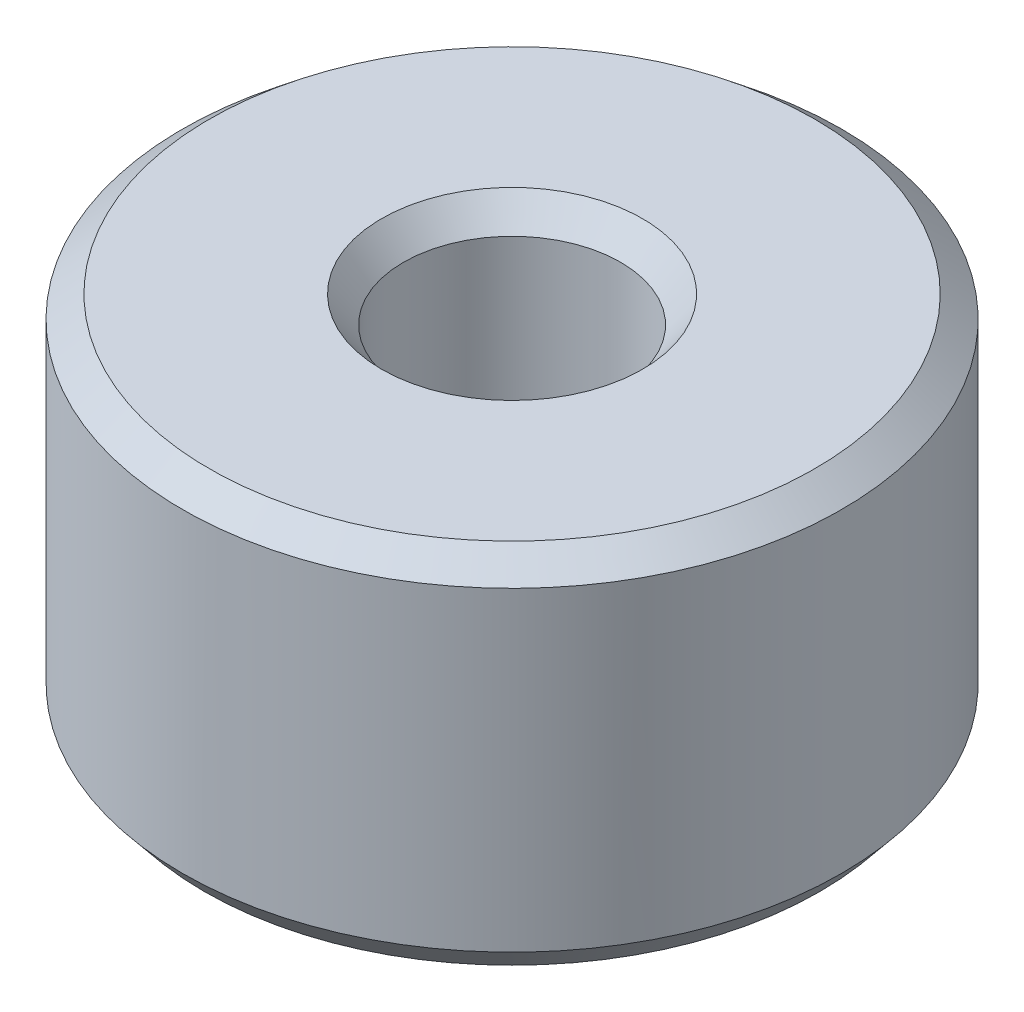
ISO-10303-21;
HEADER;
FILE_DESCRIPTION(('STEP AP214'),'2;1');
FILE_NAME('part.step','',(''),(''),'','','');
FILE_SCHEMA(('AUTOMOTIVE_DESIGN { 1 0 10303 214 1 1 1 1 }'));
ENDSEC;
DATA;
#1=APPLICATION_CONTEXT('core data for automotive mechanical design processes');
#2=APPLICATION_PROTOCOL_DEFINITION('international standard','automotive_design',2000,#1);
#3=PRODUCT_CONTEXT('',#1,'mechanical');
#4=PRODUCT('Part','Part','',(#3));
#5=PRODUCT_RELATED_PRODUCT_CATEGORY('part','',(#4));
#6=PRODUCT_DEFINITION_FORMATION('','',#4);
#7=PRODUCT_DEFINITION_CONTEXT('part definition',#1,'design');
#8=PRODUCT_DEFINITION('design','',#6,#7);
#9=PRODUCT_DEFINITION_SHAPE('','',#8);
#10=(LENGTH_UNIT() NAMED_UNIT(*) SI_UNIT(.MILLI.,.METRE.));
#11=(NAMED_UNIT(*) PLANE_ANGLE_UNIT() SI_UNIT($,.RADIAN.));
#12=(NAMED_UNIT(*) SI_UNIT($,.STERADIAN.) SOLID_ANGLE_UNIT());
#13=UNCERTAINTY_MEASURE_WITH_UNIT(LENGTH_MEASURE(1.E-05),#10,'distance_accuracy_value','');
#14=(GEOMETRIC_REPRESENTATION_CONTEXT(3) GLOBAL_UNCERTAINTY_ASSIGNED_CONTEXT((#13)) GLOBAL_UNIT_ASSIGNED_CONTEXT((#10,
#11,#12)) REPRESENTATION_CONTEXT('',''));
#15=CARTESIAN_POINT('',(0.,0.,0.));
#16=DIRECTION('',(0.,0.,1.));
#17=DIRECTION('',(1.,0.,0.));
#18=AXIS2_PLACEMENT_3D('',#15,#16,#17);
#19=CARTESIAN_POINT('',(0.,5.5202389889284,0.));
#20=DIRECTION('',(0.,-1.,0.));
#21=DIRECTION('',(0.,0.,-1.));
#22=AXIS2_PLACEMENT_3D('',#19,#20,#21);
#23=CYLINDRICAL_SURFACE('',#22,5.);
#24=CARTESIAN_POINT('',(0.,0.406698637745864,0.));
#25=DIRECTION('',(0.,1.,0.));
#26=DIRECTION('',(0.,0.,1.));
#27=AXIS2_PLACEMENT_3D('',#24,#25,#26);
#28=CIRCLE('',#27,5.);
#29=CARTESIAN_POINT('',(0.,0.406698637745864,5.));
#30=VERTEX_POINT('',#29);
#31=EDGE_CURVE('E10',#30,#30,#28,.T.);
#32=ORIENTED_EDGE('',*,*,#31,.T.);
#33=EDGE_LOOP('',(#32));
#34=FACE_BOUND('',#33,.T.);
#35=CARTESIAN_POINT('',(0.,5.1872709028626,0.));
#36=DIRECTION('',(0.,1.,0.));
#37=DIRECTION('',(0.,0.,1.));
#38=AXIS2_PLACEMENT_3D('',#35,#36,#37);
#39=CIRCLE('',#38,5.);
#40=CARTESIAN_POINT('',(0.,5.1872709028626,-5.));
#41=VERTEX_POINT('',#40);
#42=EDGE_CURVE('E50',#41,#41,#39,.F.);
#43=ORIENTED_EDGE('',*,*,#42,.T.);
#44=EDGE_LOOP('',(#43));
#45=FACE_BOUND('',#44,.T.);
#46=ADVANCED_FACE('F39',(#34,#45),#23,.T.);
#47=CARTESIAN_POINT('',(0.,5.5202389889284,0.));
#48=DIRECTION('',(0.,1.,0.));
#49=DIRECTION('',(0.,0.,1.));
#50=AXIS2_PLACEMENT_3D('',#47,#48,#49);
#51=PLANE('',#50);
#52=CARTESIAN_POINT('',(0.,5.5202389889284,0.));
#53=DIRECTION('',(0.,1.,0.));
#54=DIRECTION('',(0.,0.,1.));
#55=AXIS2_PLACEMENT_3D('',#52,#53,#54);
#56=CIRCLE('',#55,1.98005558829673);
#57=CARTESIAN_POINT('',(0.,5.5202389889284,1.98005558829673));
#58=VERTEX_POINT('',#57);
#59=EDGE_CURVE('E58',#58,#58,#56,.F.);
#60=ORIENTED_EDGE('',*,*,#59,.T.);
#61=EDGE_LOOP('',(#60));
#62=FACE_BOUND('',#61,.T.);
#63=CARTESIAN_POINT('',(0.,5.5202389889284,0.));
#64=DIRECTION('',(0.,1.,0.));
#65=DIRECTION('',(0.,0.,1.));
#66=AXIS2_PLACEMENT_3D('',#63,#64,#65);
#67=CIRCLE('',#66,4.59330136225413);
#68=CARTESIAN_POINT('',(0.,5.5202389889284,-4.59330136225413));
#69=VERTEX_POINT('',#68);
#70=EDGE_CURVE('E61',#69,#69,#67,.T.);
#71=ORIENTED_EDGE('',*,*,#70,.T.);
#72=EDGE_LOOP('',(#71));
#73=FACE_BOUND('',#72,.T.);
#74=ADVANCED_FACE('F88',(#62,#73),#51,.T.);
#75=CARTESIAN_POINT('',(0.,0.,0.));
#76=DIRECTION('',(0.,1.,0.));
#77=DIRECTION('',(0.,0.,1.));
#78=AXIS2_PLACEMENT_3D('',#75,#76,#77);
#79=PLANE('',#78);
#80=CARTESIAN_POINT('',(0.,0.,0.));
#81=DIRECTION('',(0.,1.,0.));
#82=DIRECTION('',(0.,0.,1.));
#83=AXIS2_PLACEMENT_3D('',#80,#81,#82);
#84=CIRCLE('',#83,2.0537861399768);
#85=CARTESIAN_POINT('',(0.,0.,2.0537861399768));
#86=VERTEX_POINT('',#85);
#87=EDGE_CURVE('E51',#86,#86,#84,.T.);
#88=ORIENTED_EDGE('',*,*,#87,.T.);
#89=EDGE_LOOP('',(#88));
#90=FACE_BOUND('',#89,.T.);
#91=CARTESIAN_POINT('',(0.,0.,0.));
#92=DIRECTION('',(0.,1.,0.));
#93=DIRECTION('',(0.,0.,1.));
#94=AXIS2_PLACEMENT_3D('',#91,#92,#93);
#95=CIRCLE('',#94,4.6670319139342);
#96=CARTESIAN_POINT('',(0.,0.,4.6670319139342));
#97=VERTEX_POINT('',#96);
#98=EDGE_CURVE('E54',#97,#97,#95,.F.);
#99=ORIENTED_EDGE('',*,*,#98,.T.);
#100=EDGE_LOOP('',(#99));
#101=FACE_BOUND('',#100,.T.);
#102=ADVANCED_FACE('F83',(#90,#101),#79,.F.);
#103=CARTESIAN_POINT('',(0.,5.5202389889284,0.));
#104=DIRECTION('',(0.,-1.,0.));
#105=DIRECTION('',(0.,0.,-1.));
#106=AXIS2_PLACEMENT_3D('',#103,#104,#105);
#107=CYLINDRICAL_SURFACE('',#106,1.64708750223094);
#108=CARTESIAN_POINT('',(0.,5.11354035118254,0.));
#109=DIRECTION('',(0.,1.,0.));
#110=DIRECTION('',(0.,0.,1.));
#111=AXIS2_PLACEMENT_3D('',#108,#109,#110);
#112=CIRCLE('',#111,1.64708750223094);
#113=CARTESIAN_POINT('',(0.,5.11354035118254,1.64708750223094));
#114=VERTEX_POINT('',#113);
#115=EDGE_CURVE('E67',#114,#114,#112,.T.);
#116=ORIENTED_EDGE('',*,*,#115,.T.);
#117=EDGE_LOOP('',(#116));
#118=FACE_BOUND('',#117,.T.);
#119=CARTESIAN_POINT('',(0.,0.332968086065793,0.));
#120=DIRECTION('',(0.,1.,0.));
#121=DIRECTION('',(0.,0.,1.));
#122=AXIS2_PLACEMENT_3D('',#119,#120,#121);
#123=CIRCLE('',#122,1.64708750223094);
#124=CARTESIAN_POINT('',(0.,0.332968086065793,1.64708750223094));
#125=VERTEX_POINT('',#124);
#126=EDGE_CURVE('E69',#125,#125,#123,.F.);
#127=ORIENTED_EDGE('',*,*,#126,.T.);
#128=EDGE_LOOP('',(#127));
#129=FACE_BOUND('',#128,.T.);
#130=ADVANCED_FACE('F71',(#118,#129),#107,.F.);
#131=CARTESIAN_POINT('',(0.,5.11354035118254,0.));
#132=DIRECTION('',(0.,1.,0.));
#133=DIRECTION('',(0.,0.,1.));
#134=AXIS2_PLACEMENT_3D('',#131,#132,#133);
#135=CONICAL_SURFACE('',#134,1.64708750223094,0.686045586033582);
#136=ORIENTED_EDGE('',*,*,#59,.F.);
#137=EDGE_LOOP('',(#136));
#138=FACE_BOUND('',#137,.T.);
#139=ORIENTED_EDGE('',*,*,#115,.F.);
#140=EDGE_LOOP('',(#139));
#141=FACE_BOUND('',#140,.T.);
#142=ADVANCED_FACE('F77',(#138,#141),#135,.F.);
#143=CARTESIAN_POINT('',(0.,0.,0.));
#144=DIRECTION('',(0.,-1.,0.));
#145=DIRECTION('',(0.,0.,-1.));
#146=AXIS2_PLACEMENT_3D('',#143,#144,#145);
#147=CONICAL_SURFACE('',#146,2.0537861399768,0.884750740761318);
#148=ORIENTED_EDGE('',*,*,#126,.F.);
#149=EDGE_LOOP('',(#148));
#150=FACE_BOUND('',#149,.T.);
#151=ORIENTED_EDGE('',*,*,#87,.F.);
#152=EDGE_LOOP('',(#151));
#153=FACE_BOUND('',#152,.T.);
#154=ADVANCED_FACE('F73',(#150,#153),#147,.F.);
#155=CARTESIAN_POINT('',(0.,0.406698637745864,0.));
#156=DIRECTION('',(0.,1.,0.));
#157=DIRECTION('',(0.,0.,1.));
#158=AXIS2_PLACEMENT_3D('',#155,#156,#157);
#159=CONICAL_SURFACE('',#158,5.,0.686045586033583);
#160=ORIENTED_EDGE('',*,*,#98,.F.);
#161=EDGE_LOOP('',(#160));
#162=FACE_BOUND('',#161,.T.);
#163=ORIENTED_EDGE('',*,*,#31,.F.);
#164=EDGE_LOOP('',(#163));
#165=FACE_BOUND('',#164,.T.);
#166=ADVANCED_FACE('F76',(#162,#165),#159,.T.);
#167=CARTESIAN_POINT('',(0.,5.5202389889284,0.));
#168=DIRECTION('',(0.,-1.,0.));
#169=DIRECTION('',(0.,0.,-1.));
#170=AXIS2_PLACEMENT_3D('',#167,#168,#169);
#171=CONICAL_SURFACE('',#170,4.59330136225413,0.884750740761318);
#172=CARTESIAN_POINT('',(0.,5.1872709028626,-5.));
#173=CARTESIAN_POINT('',(0.,5.19073932042579,-4.99576355585681));
#174=CARTESIAN_POINT('',(0.,5.19420773798898,-4.99152711171363));
#175=CARTESIAN_POINT('',(0.,5.20114457311535,-4.98305422342726));
#176=CARTESIAN_POINT('',(0.,5.20461299067853,-4.97881777928407));
#177=CARTESIAN_POINT('',(0.,5.2115498258049,-4.9703448909977));
#178=CARTESIAN_POINT('',(0.,5.21501824336809,-4.96610844685451));
#179=CARTESIAN_POINT('',(0.,5.22195507849446,-4.95763555856814));
#180=CARTESIAN_POINT('',(0.,5.22542349605764,-4.95339911442495));
#181=CARTESIAN_POINT('',(0.,5.23236033118401,-4.94492622613858));
#182=CARTESIAN_POINT('',(0.,5.2358287487472,-4.9406897819954));
#183=CARTESIAN_POINT('',(0.,5.24276558387357,-4.93221689370902));
#184=CARTESIAN_POINT('',(0.,5.24623400143676,-4.92798044956584));
#185=CARTESIAN_POINT('',(0.,5.25317083656313,-4.91950756127946));
#186=CARTESIAN_POINT('',(0.,5.25663925412631,-4.91527111713628));
#187=CARTESIAN_POINT('',(0.,5.26357608925268,-4.90679822884991));
#188=CARTESIAN_POINT('',(0.,5.26704450681587,-4.90256178470672));
#189=CARTESIAN_POINT('',(0.,5.27398134194224,-4.89408889642035));
#190=CARTESIAN_POINT('',(0.,5.27744975950542,-4.88985245227716));
#191=CARTESIAN_POINT('',(0.,5.28438659463179,-4.88137956399079));
#192=CARTESIAN_POINT('',(0.,5.28785501219498,-4.8771431198476));
#193=CARTESIAN_POINT('',(0.,5.29479184732135,-4.86867023156123));
#194=CARTESIAN_POINT('',(0.,5.29826026488454,-4.86443378741805));
#195=CARTESIAN_POINT('',(0.,5.30519710001091,-4.85596089913167));
#196=CARTESIAN_POINT('',(0.,5.30866551757409,-4.85172445498849));
#197=CARTESIAN_POINT('',(0.,5.31560235270046,-4.84325156670211));
#198=CARTESIAN_POINT('',(0.,5.31907077026365,-4.83901512255893));
#199=CARTESIAN_POINT('',(0.,5.32600760539002,-4.83054223427256));
#200=CARTESIAN_POINT('',(0.,5.32947602295321,-4.82630579012937));
#201=CARTESIAN_POINT('',(0.,5.33641285807958,-4.817832901843));
#202=CARTESIAN_POINT('',(0.,5.33988127564276,-4.81359645769981));
#203=CARTESIAN_POINT('',(0.,5.34681811076913,-4.80512356941344));
#204=CARTESIAN_POINT('',(0.,5.35028652833232,-4.80088712527025));
#205=CARTESIAN_POINT('',(0.,5.35722336345869,-4.79241423698388));
#206=CARTESIAN_POINT('',(0.,5.36069178102187,-4.7881777928407));
#207=CARTESIAN_POINT('',(0.,5.36762861614824,-4.77970490455432));
#208=CARTESIAN_POINT('',(0.,5.37109703371143,-4.77546846041114));
#209=CARTESIAN_POINT('',(0.,5.3780338688378,-4.76699557212476));
#210=CARTESIAN_POINT('',(0.,5.38150228640098,-4.76275912798158));
#211=CARTESIAN_POINT('',(0.,5.38843912152736,-4.75428623969521));
#212=CARTESIAN_POINT('',(0.,5.39190753909054,-4.75004979555202));
#213=CARTESIAN_POINT('',(0.,5.39884437421691,-4.74157690726565));
#214=CARTESIAN_POINT('',(0.,5.4023127917801,-4.73734046312246));
#215=CARTESIAN_POINT('',(0.,5.40924962690647,-4.72886757483609));
#216=CARTESIAN_POINT('',(0.,5.41271804446965,-4.7246311306929));
#217=CARTESIAN_POINT('',(0.,5.41965487959602,-4.71615824240653));
#218=CARTESIAN_POINT('',(0.,5.42312329715921,-4.71192179826335));
#219=CARTESIAN_POINT('',(0.,5.43006013228558,-4.70344890997697));
#220=CARTESIAN_POINT('',(0.,5.43352854984877,-4.69921246583379));
#221=CARTESIAN_POINT('',(0.,5.44046538497514,-4.69073957754741));
#222=CARTESIAN_POINT('',(0.,5.44393380253832,-4.68650313340423));
#223=CARTESIAN_POINT('',(0.,5.45087063766469,-4.67803024511786));
#224=CARTESIAN_POINT('',(0.,5.45433905522788,-4.67379380097467));
#225=CARTESIAN_POINT('',(0.,5.46127589035425,-4.6653209126883));
#226=CARTESIAN_POINT('',(0.,5.46474430791744,-4.66108446854511));
#227=CARTESIAN_POINT('',(0.,5.47168114304381,-4.65261158025874));
#228=CARTESIAN_POINT('',(0.,5.47514956060699,-4.64837513611555));
#229=CARTESIAN_POINT('',(0.,5.48208639573336,-4.63990224782918));
#230=CARTESIAN_POINT('',(0.,5.48555481329655,-4.635665803686));
#231=CARTESIAN_POINT('',(0.,5.49249164842292,-4.62719291539962));
#232=CARTESIAN_POINT('',(0.,5.4959600659861,-4.62295647125644));
#233=CARTESIAN_POINT('',(0.,5.50289690111247,-4.61448358297007));
#234=CARTESIAN_POINT('',(0.,5.50636531867566,-4.61024713882688));
#235=CARTESIAN_POINT('',(0.,5.51330215380203,-4.60177425054051));
#236=CARTESIAN_POINT('',(0.,5.51677057136522,-4.59753780639732));
#237=CARTESIAN_POINT('',(0.,5.5202389889284,-4.59330136225413));
#238=B_SPLINE_CURVE_WITH_KNOTS('',3,(#172,#173,#174,#175,#176,#177,#178,#179,#180,#181,#182,
#183,#184,#185,#186,#187,#188,#189,#190,#191,#192,#193,#194,#195,#196,#197,#198,#199,#200,#201,
#202,#203,#204,#205,#206,#207,#208,#209,#210,#211,#212,#213,#214,#215,#216,#217,#218,#219,#220,
#221,#222,#223,#224,#225,#226,#227,#228,#229,#230,#231,#232,#233,#234,#235,#236,#237),
.UNSPECIFIED.,.F.,.F.,(4,2,2,2,2,2,2,2,2,2,2,2,2,2,2,2,2,2,2,2,2,2,2,2,2,2,2,2,2,2,2,2,4),(0.,
0.0164254806425428,0.032850961285085,0.0492764419276278,0.06570192257017,0.0821274032127128,
0.098552883855255,0.114978364497798,0.13140384514034,0.147829325782883,0.164254806425425,
0.180680287067968,0.19710576771051,0.213531248353053,0.229956728995595,0.246382209638138,
0.26280769028068,0.279233170923223,0.295658651565765,0.312084132208308,0.32850961285085,
0.344935093493393,0.361360574135935,0.377786054778478,0.394211535421021,0.410637016063563,
0.427062496706106,0.443487977348648,0.459913457991191,0.476338938633732,0.492764419276275,
0.509189899918817,0.52561538056136),.UNSPECIFIED.);
#239=EDGE_CURVE('BSEAM45',#41,#69,#238,.T.);
#240=ORIENTED_EDGE('',*,*,#42,.F.);
#241=ORIENTED_EDGE('',*,*,#70,.F.);
#242=ORIENTED_EDGE('',*,*,#239,.T.);
#243=ORIENTED_EDGE('',*,*,#239,.F.);
#244=EDGE_LOOP('',(#240,#242,#241,#243));
#245=FACE_BOUND('',#244,.T.);
#246=ADVANCED_FACE('F45',(#245),#171,.T.);
#247=CLOSED_SHELL('',(#46,#74,#102,#130,#142,#154,#166,#246));
#248=MANIFOLD_SOLID_BREP('B2',#247);
#249=ADVANCED_BREP_SHAPE_REPRESENTATION('',(#18,#248),#14);
#250=SHAPE_DEFINITION_REPRESENTATION(#9,#249);
ENDSEC;
END-ISO-10303-21;
